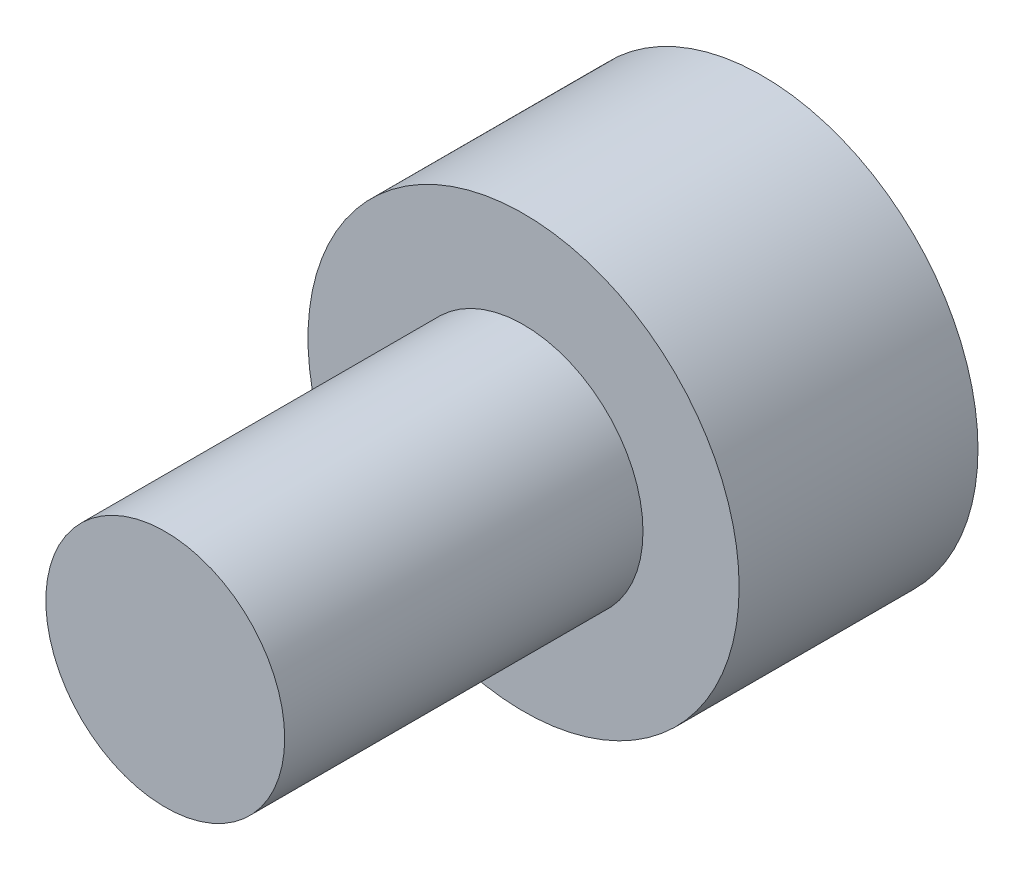
ISO-10303-21;
HEADER;
FILE_DESCRIPTION(('STEP AP214'),'2;1');
FILE_NAME('part.step','',(''),(''),'','','');
FILE_SCHEMA(('AUTOMOTIVE_DESIGN { 1 0 10303 214 1 1 1 1 }'));
ENDSEC;
DATA;
#1=APPLICATION_CONTEXT('core data for automotive mechanical design processes');
#2=APPLICATION_PROTOCOL_DEFINITION('international standard','automotive_design',2000,#1);
#3=PRODUCT_CONTEXT('',#1,'mechanical');
#4=PRODUCT('Part','Part','',(#3));
#5=PRODUCT_RELATED_PRODUCT_CATEGORY('part','',(#4));
#6=PRODUCT_DEFINITION_FORMATION('','',#4);
#7=PRODUCT_DEFINITION_CONTEXT('part definition',#1,'design');
#8=PRODUCT_DEFINITION('design','',#6,#7);
#9=PRODUCT_DEFINITION_SHAPE('','',#8);
#10=(LENGTH_UNIT() NAMED_UNIT(*) SI_UNIT(.MILLI.,.METRE.));
#11=(NAMED_UNIT(*) PLANE_ANGLE_UNIT() SI_UNIT($,.RADIAN.));
#12=(NAMED_UNIT(*) SI_UNIT($,.STERADIAN.) SOLID_ANGLE_UNIT());
#13=UNCERTAINTY_MEASURE_WITH_UNIT(LENGTH_MEASURE(1.E-05),#10,'distance_accuracy_value','');
#14=(GEOMETRIC_REPRESENTATION_CONTEXT(3) GLOBAL_UNCERTAINTY_ASSIGNED_CONTEXT((#13)) GLOBAL_UNIT_ASSIGNED_CONTEXT((#10,
#11,#12)) REPRESENTATION_CONTEXT('',''));
#15=CARTESIAN_POINT('',(0.,0.,0.));
#16=DIRECTION('',(0.,0.,1.));
#17=DIRECTION('',(1.,0.,0.));
#18=AXIS2_PLACEMENT_3D('',#15,#16,#17);
#19=CARTESIAN_POINT('',(0.,0.,4.));
#20=DIRECTION('',(0.,0.,-1.));
#21=DIRECTION('',(-1.,0.,0.));
#22=AXIS2_PLACEMENT_3D('',#19,#20,#21);
#23=CYLINDRICAL_SURFACE('',#22,3.61);
#24=CARTESIAN_POINT('',(0.,0.,4.));
#25=DIRECTION('',(0.,0.,1.));
#26=DIRECTION('',(1.,0.,0.));
#27=AXIS2_PLACEMENT_3D('',#24,#25,#26);
#28=CIRCLE('',#27,3.61);
#29=CARTESIAN_POINT('',(3.61,0.,4.));
#30=VERTEX_POINT('',#29);
#31=EDGE_CURVE('E44',#30,#30,#28,.T.);
#32=ORIENTED_EDGE('',*,*,#31,.F.);
#33=EDGE_LOOP('',(#32));
#34=FACE_BOUND('',#33,.T.);
#35=CARTESIAN_POINT('',(0.,0.,0.));
#36=DIRECTION('',(0.,0.,1.));
#37=DIRECTION('',(1.,0.,0.));
#38=AXIS2_PLACEMENT_3D('',#35,#36,#37);
#39=CIRCLE('',#38,3.61);
#40=CARTESIAN_POINT('',(3.61,0.,0.));
#41=VERTEX_POINT('',#40);
#42=EDGE_CURVE('E40',#41,#41,#39,.T.);
#43=ORIENTED_EDGE('',*,*,#42,.T.);
#44=EDGE_LOOP('',(#43));
#45=FACE_BOUND('',#44,.T.);
#46=ADVANCED_FACE('F37',(#34,#45),#23,.T.);
#47=CARTESIAN_POINT('',(0.,0.,4.));
#48=DIRECTION('',(0.,0.,1.));
#49=DIRECTION('',(1.,0.,0.));
#50=AXIS2_PLACEMENT_3D('',#47,#48,#49);
#51=PLANE('',#50);
#52=CARTESIAN_POINT('',(0.,0.,4.));
#53=DIRECTION('',(0.,0.,1.));
#54=DIRECTION('',(1.,0.,0.));
#55=AXIS2_PLACEMENT_3D('',#52,#53,#54);
#56=CIRCLE('',#55,2.);
#57=CARTESIAN_POINT('',(2.,0.,4.));
#58=VERTEX_POINT('',#57);
#59=EDGE_CURVE('E10',#58,#58,#56,.T.);
#60=ORIENTED_EDGE('',*,*,#59,.F.);
#61=EDGE_LOOP('',(#60));
#62=FACE_BOUND('',#61,.T.);
#63=ORIENTED_EDGE('',*,*,#31,.T.);
#64=EDGE_LOOP('',(#63));
#65=FACE_BOUND('',#64,.T.);
#66=ADVANCED_FACE('F61',(#62,#65),#51,.T.);
#67=CARTESIAN_POINT('',(0.,0.,0.));
#68=DIRECTION('',(0.,0.,1.));
#69=DIRECTION('',(1.,0.,0.));
#70=AXIS2_PLACEMENT_3D('',#67,#68,#69);
#71=PLANE('',#70);
#72=ORIENTED_EDGE('',*,*,#42,.F.);
#73=EDGE_LOOP('',(#72));
#74=FACE_BOUND('',#73,.T.);
#75=ADVANCED_FACE('F58',(#74),#71,.F.);
#76=CARTESIAN_POINT('',(0.,0.,10.));
#77=DIRECTION('',(0.,0.,-1.));
#78=DIRECTION('',(-1.,0.,0.));
#79=AXIS2_PLACEMENT_3D('',#76,#77,#78);
#80=CYLINDRICAL_SURFACE('',#79,2.);
#81=CARTESIAN_POINT('',(0.,0.,10.));
#82=DIRECTION('',(0.,0.,1.));
#83=DIRECTION('',(1.,0.,0.));
#84=AXIS2_PLACEMENT_3D('',#81,#82,#83);
#85=CIRCLE('',#84,2.);
#86=CARTESIAN_POINT('',(2.,0.,10.));
#87=VERTEX_POINT('',#86);
#88=EDGE_CURVE('E50',#87,#87,#85,.T.);
#89=ORIENTED_EDGE('',*,*,#88,.F.);
#90=EDGE_LOOP('',(#89));
#91=FACE_BOUND('',#90,.T.);
#92=ORIENTED_EDGE('',*,*,#59,.T.);
#93=EDGE_LOOP('',(#92));
#94=FACE_BOUND('',#93,.T.);
#95=ADVANCED_FACE('F60',(#91,#94),#80,.T.);
#96=CARTESIAN_POINT('',(0.,0.,10.));
#97=DIRECTION('',(0.,0.,1.));
#98=DIRECTION('',(1.,0.,0.));
#99=AXIS2_PLACEMENT_3D('',#96,#97,#98);
#100=PLANE('',#99);
#101=ORIENTED_EDGE('',*,*,#88,.T.);
#102=EDGE_LOOP('',(#101));
#103=FACE_BOUND('',#102,.T.);
#104=ADVANCED_FACE('F66',(#103),#100,.T.);
#105=CLOSED_SHELL('',(#46,#66,#75,#95,#104));
#106=MANIFOLD_SOLID_BREP('B2',#105);
#107=ADVANCED_BREP_SHAPE_REPRESENTATION('',(#18,#106),#14);
#108=SHAPE_DEFINITION_REPRESENTATION(#9,#107);
ENDSEC;
END-ISO-10303-21;
